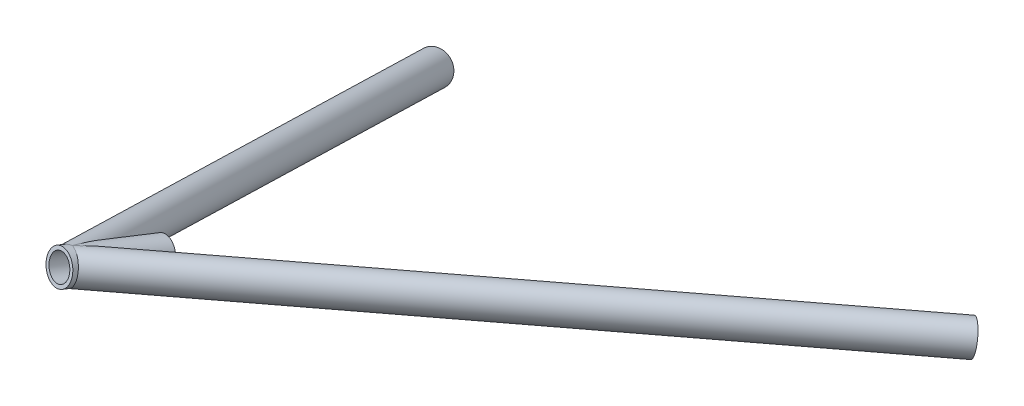
ISO-10303-21;
HEADER;
FILE_DESCRIPTION(('STEP AP214'),'2;1');
FILE_NAME('part.step','',(''),(''),'','','');
FILE_SCHEMA(('AUTOMOTIVE_DESIGN { 1 0 10303 214 1 1 1 1 }'));
ENDSEC;
DATA;
#1=APPLICATION_CONTEXT('core data for automotive mechanical design processes');
#2=APPLICATION_PROTOCOL_DEFINITION('international standard','automotive_design',2000,#1);
#3=PRODUCT_CONTEXT('',#1,'mechanical');
#4=PRODUCT('Part','Part','',(#3));
#5=PRODUCT_RELATED_PRODUCT_CATEGORY('part','',(#4));
#6=PRODUCT_DEFINITION_FORMATION('','',#4);
#7=PRODUCT_DEFINITION_CONTEXT('part definition',#1,'design');
#8=PRODUCT_DEFINITION('design','',#6,#7);
#9=PRODUCT_DEFINITION_SHAPE('','',#8);
#10=(LENGTH_UNIT() NAMED_UNIT(*) SI_UNIT(.MILLI.,.METRE.));
#11=(NAMED_UNIT(*) PLANE_ANGLE_UNIT() SI_UNIT($,.RADIAN.));
#12=(NAMED_UNIT(*) SI_UNIT($,.STERADIAN.) SOLID_ANGLE_UNIT());
#13=UNCERTAINTY_MEASURE_WITH_UNIT(LENGTH_MEASURE(1.E-05),#10,'distance_accuracy_value','');
#14=(GEOMETRIC_REPRESENTATION_CONTEXT(3) GLOBAL_UNCERTAINTY_ASSIGNED_CONTEXT((#13)) GLOBAL_UNIT_ASSIGNED_CONTEXT((#10,
#11,#12)) REPRESENTATION_CONTEXT('',''));
#15=CARTESIAN_POINT('',(0.,0.,0.));
#16=DIRECTION('',(0.,0.,1.));
#17=DIRECTION('',(1.,0.,0.));
#18=AXIS2_PLACEMENT_3D('',#15,#16,#17);
#19=CARTESIAN_POINT('',(1696.18593125395,298.313265774571,609.984435723738));
#20=DIRECTION('',(0.586936783063146,-0.193365264339262,-0.786202955498447));
#21=DIRECTION('',(-0.801326519780633,0.,-0.598227221627584));
#22=AXIS2_PLACEMENT_3D('',#19,#20,#21);
#23=CYLINDRICAL_SURFACE('',#22,7.41680000000007);
#24=CARTESIAN_POINT('',(1929.45721259279,221.462462961638,297.517103442446));
#25=DIRECTION('',(-0.586936783063146,0.193365264339262,0.786202955498447));
#26=DIRECTION('',(0.801326519780633,0.,0.598227221627584));
#27=AXIS2_PLACEMENT_3D('',#24,#25,#26);
#28=CIRCLE('',#27,7.41680000000007);
#29=CARTESIAN_POINT('',(1935.4004911247,221.462462961638,301.954035099813));
#30=VERTEX_POINT('',#29);
#31=EDGE_CURVE('E107',#30,#30,#28,.T.);
#32=ORIENTED_EDGE('',*,*,#31,.F.);
#33=EDGE_LOOP('',(#32));
#34=FACE_BOUND('',#33,.T.);
#35=CARTESIAN_POINT('',(1712.03955486723,291.132315684709,576.350511508126));
#36=CARTESIAN_POINT('',(1712.07658497035,291.016248629587,576.300908607568));
#37=CARTESIAN_POINT('',(1712.11207509683,290.897242727666,576.256864690043));
#38=CARTESIAN_POINT('',(1712.17864311787,290.653362032852,576.183487458711));
#39=CARTESIAN_POINT('',(1712.20971879644,290.52848433398,576.154161514517));
#40=CARTESIAN_POINT('',(1712.26594423027,290.27230217174,576.114550975179));
#41=CARTESIAN_POINT('',(1712.29100463676,290.140932082762,576.1045395689));
#42=CARTESIAN_POINT('',(1712.33218706204,289.877324729745,576.109257153488));
#43=CARTESIAN_POINT('',(1712.34833512454,289.74509114725,576.12391354621));
#44=CARTESIAN_POINT('',(1712.36873326322,289.500791048101,576.176674578998));
#45=CARTESIAN_POINT('',(1712.37416018927,289.388182955529,576.21181578729));
#46=CARTESIAN_POINT('',(1712.37668060772,289.170742355862,576.301338622151));
#47=CARTESIAN_POINT('',(1712.37376445541,289.065918991679,576.355742452868));
#48=CARTESIAN_POINT('',(1712.35948631222,288.850410188001,576.49016313902));
#49=CARTESIAN_POINT('',(1712.3468294117,288.741538143218,576.572904944146));
#50=CARTESIAN_POINT('',(1712.31382051871,288.53810421147,576.753064671234));
#51=CARTESIAN_POINT('',(1712.29345401726,288.443569779741,576.850510055139));
#52=CARTESIAN_POINT('',(1712.25053414276,288.280529543587,577.039905272961));
#53=CARTESIAN_POINT('',(1712.22875111139,288.21024232212,577.130532365055));
#54=CARTESIAN_POINT('',(1712.18204352185,288.07780028612,577.31683563695));
#55=CARTESIAN_POINT('',(1712.15711652896,288.015651851273,577.412515696118));
#56=CARTESIAN_POINT('',(1712.10479601727,287.898263920755,577.607647609773));
#57=CARTESIAN_POINT('',(1712.07739689197,287.843040844464,577.707107725782));
#58=CARTESIAN_POINT('',(1712.02071898795,287.738682589971,577.908580036128));
#59=CARTESIAN_POINT('',(1711.9914407935,287.68954553322,578.010591431227));
#60=CARTESIAN_POINT('',(1711.91693730902,287.574089366037,578.266078100127));
#61=CARTESIAN_POINT('',(1711.87081821702,287.51088127217,578.420694893387));
#62=CARTESIAN_POINT('',(1711.77617789931,287.393734608016,578.732714793343));
#63=CARTESIAN_POINT('',(1711.72765543724,287.339800873888,578.890119306809));
#64=CARTESIAN_POINT('',(1711.62872894047,287.239552813774,579.207061835553));
#65=CARTESIAN_POINT('',(1711.57832175554,287.193252014725,579.366603108042));
#66=CARTESIAN_POINT('',(1711.47611842774,287.107161490387,579.686996390202));
#67=CARTESIAN_POINT('',(1711.42432212099,287.067372537371,579.847848552966));
#68=CARTESIAN_POINT('',(1711.31934552606,286.993160402487,580.171398701596));
#69=CARTESIAN_POINT('',(1711.26615899138,286.958769397608,580.334101982764));
#70=CARTESIAN_POINT('',(1711.15891679189,286.894881224651,580.660180432866));
#71=CARTESIAN_POINT('',(1711.10486109718,286.86538422524,580.823555624758));
#72=CARTESIAN_POINT('',(1710.99612147059,286.810721823565,581.150594661971));
#73=CARTESIAN_POINT('',(1710.94143836376,286.78555130336,581.314257931626));
#74=CARTESIAN_POINT('',(1710.83151783514,286.739022711283,581.6419327401));
#75=CARTESIAN_POINT('',(1710.77628041941,286.717664597761,581.805944275096));
#76=CARTESIAN_POINT('',(1710.61641090879,286.66101009951,582.279098936916));
#77=CARTESIAN_POINT('',(1710.51121193253,286.630049333578,582.588573444953));
#78=CARTESIAN_POINT('',(1710.29979138591,286.578181544837,583.208032451481));
#79=CARTESIAN_POINT('',(1710.19356967737,286.557275900549,583.518017014057));
#80=CARTESIAN_POINT('',(1709.98047083585,286.524065369149,584.138370852052));
#81=CARTESIAN_POINT('',(1709.87359342688,286.511764396117,584.448740238297));
#82=CARTESIAN_POINT('',(1709.65954871433,286.494684108432,585.069595275297));
#83=CARTESIAN_POINT('',(1709.55238139593,286.489905185709,585.380080931267));
#84=CARTESIAN_POINT('',(1709.33777682453,286.487030671917,586.00180972391));
#85=CARTESIAN_POINT('',(1709.23033953401,286.488950954797,586.313052911034));
#86=CARTESIAN_POINT('',(1709.01568785097,286.498863734382,586.935522774005));
#87=CARTESIAN_POINT('',(1708.90847346486,286.506856402979,587.246749449136));
#88=CARTESIAN_POINT('',(1708.587564373,286.539144850831,588.180189080425));
#89=CARTESIAN_POINT('',(1708.3745366263,286.571750871382,588.802355268866));
#90=CARTESIAN_POINT('',(1707.952316236,286.656247492503,590.045737529847));
#91=CARTESIAN_POINT('',(1707.74311896728,286.708112970963,590.666953786179));
#92=CARTESIAN_POINT('',(1707.33019693435,286.829636965709,591.909537830945));
#93=CARTESIAN_POINT('',(1707.12647276677,286.899297413179,592.530905628508));
#94=CARTESIAN_POINT('',(1706.72723866972,287.055779916383,593.77306265047));
#95=CARTESIAN_POINT('',(1706.53171643825,287.142575068174,594.393851268229));
#96=CARTESIAN_POINT('',(1706.24682508677,287.28613974271,595.325480851698));
#97=CARTESIAN_POINT('',(1706.15326499031,287.336220102417,595.636081023833));
#98=CARTESIAN_POINT('',(1705.96948073648,287.441054385257,596.257476901621));
#99=CARTESIAN_POINT('',(1705.87925652701,287.495808235362,596.568272604145));
#100=CARTESIAN_POINT('',(1705.66884575387,287.632280011369,597.309592790259));
#101=CARTESIAN_POINT('',(1705.55047230958,287.7162727698,597.740220382242));
#102=CARTESIAN_POINT('',(1705.32342652983,287.895009065529,598.601939264552));
#103=CARTESIAN_POINT('',(1705.21475658885,287.989755243362,599.033030642912));
#104=CARTESIAN_POINT('',(1705.01006728148,288.191851247254,599.895132005038));
#105=CARTESIAN_POINT('',(1704.9140421744,288.299195311779,600.326141936415));
#106=CARTESIAN_POINT('',(1704.78244967651,288.471904816642,600.972009696426));
#107=CARTESIAN_POINT('',(1704.74066305203,288.531417401198,601.187170871958));
#108=CARTESIAN_POINT('',(1704.66187153557,288.65487055869,601.617092313928));
#109=CARTESIAN_POINT('',(1704.62486638679,288.718810893548,601.831852601285));
#110=CARTESIAN_POINT('',(1704.54476534034,288.874205525519,602.333200559642));
#111=CARTESIAN_POINT('',(1704.50383897657,288.967654251779,602.619528522018));
#112=CARTESIAN_POINT('',(1704.43384741731,289.165486774651,603.189963268197));
#113=CARTESIAN_POINT('',(1704.40478422379,289.269872413183,603.474069669174));
#114=CARTESIAN_POINT('',(1704.36094240185,289.491798423494,604.03771681313));
#115=CARTESIAN_POINT('',(1704.34613858625,289.609315189554,604.31726474588));
#116=CARTESIAN_POINT('',(1704.33329796318,289.860596570841,604.869367488304));
#117=CARTESIAN_POINT('',(1704.33525181188,289.994352090569,605.141926110084));
#118=CARTESIAN_POINT('',(1704.35426843521,290.232517457915,605.584704388796));
#119=CARTESIAN_POINT('',(1704.36595361321,290.331387510807,605.758137095597));
#120=CARTESIAN_POINT('',(1704.39799239082,290.538592473899,606.098396846474));
#121=CARTESIAN_POINT('',(1704.41834295773,290.646924062236,606.265226179281));
#122=CARTESIAN_POINT('',(1704.46776436013,290.873770016219,606.590201417726));
#123=CARTESIAN_POINT('',(1704.49682471037,290.992272016521,606.748357495322));
#124=CARTESIAN_POINT('',(1704.56326373124,291.240145567829,607.054089563841));
#125=CARTESIAN_POINT('',(1704.60064219554,291.369516849172,607.201665817077));
#126=CARTESIAN_POINT('',(1704.68311811871,291.640619794724,607.485491521252));
#127=CARTESIAN_POINT('',(1704.72828560426,291.78245730518,607.621619908406));
#128=CARTESIAN_POINT('',(1704.82447361544,292.077179649872,607.879072530503));
#129=CARTESIAN_POINT('',(1704.87549426741,292.230064722526,608.000396445798));
#130=CARTESIAN_POINT('',(1704.98132967104,292.546278093969,608.226880518623));
#131=CARTESIAN_POINT('',(1705.03614642522,292.709611901163,608.332032049229));
#132=CARTESIAN_POINT('',(1705.14720860748,293.045617626346,608.525251546435));
#133=CARTESIAN_POINT('',(1705.20345395814,293.218289038873,608.613320436571));
#134=CARTESIAN_POINT('',(1705.30837622991,293.550679829153,608.762647489244));
#135=CARTESIAN_POINT('',(1705.35715802747,293.709498801764,608.825848254794));
#136=CARTESIAN_POINT('',(1705.45248350064,294.032461888309,608.938857730564));
#137=CARTESIAN_POINT('',(1705.49902740069,294.196605465476,608.988667786012));
#138=CARTESIAN_POINT('',(1705.58852376935,294.529276010192,609.075171276163));
#139=CARTESIAN_POINT('',(1705.63147593536,294.69780334551,609.111863606543));
#140=CARTESIAN_POINT('',(1705.71261039163,295.038266432537,609.172510059636));
#141=CARTESIAN_POINT('',(1705.75079239992,295.210202385042,609.19646342959));
#142=CARTESIAN_POINT('',(1705.82309969626,295.564865641273,609.232924731367));
#143=CARTESIAN_POINT('',(1705.85694056217,295.747713503338,609.244825019672));
#144=CARTESIAN_POINT('',(1705.91737346114,296.114980798895,609.255627149784));
#145=CARTESIAN_POINT('',(1705.94396535543,296.299400262402,609.254528742776));
#146=CARTESIAN_POINT('',(1705.98919598081,296.668744074213,609.239840107601));
#147=CARTESIAN_POINT('',(1706.00783345101,296.853668497888,609.226247900067));
#148=CARTESIAN_POINT('',(1706.0366374073,297.222903596839,609.187043675306));
#149=CARTESIAN_POINT('',(1706.04680359533,297.407214250293,609.1614312352));
#150=CARTESIAN_POINT('',(1706.05866768977,297.784757426962,609.096797170882));
#151=CARTESIAN_POINT('',(1706.05984126695,297.977888725907,609.057085089235));
#152=CARTESIAN_POINT('',(1706.05215826392,298.360949181745,608.965140535468));
#153=CARTESIAN_POINT('',(1706.04330128961,298.550878212518,608.912907571446));
#154=CARTESIAN_POINT('',(1706.01558840952,298.926268314493,608.796297006398));
#155=CARTESIAN_POINT('',(1705.99673050142,299.111728483189,608.731916975022));
#156=CARTESIAN_POINT('',(1705.94925953409,299.476832263983,608.591343453487));
#157=CARTESIAN_POINT('',(1705.92064647299,299.656475874966,608.515149961061));
#158=CARTESIAN_POINT('',(1705.8536084474,300.01136652067,608.349938638769));
#159=CARTESIAN_POINT('',(1705.81503816357,300.186502127179,608.260740209218));
#160=CARTESIAN_POINT('',(1705.7290308067,300.528037493043,608.070645091176));
#161=CARTESIAN_POINT('',(1705.68159356712,300.69443708822,607.969748182946));
#162=CARTESIAN_POINT('',(1705.57882728298,301.017119334387,607.756420050968));
#163=CARTESIAN_POINT('',(1705.52349776992,301.173401383967,607.643988142578));
#164=CARTESIAN_POINT('',(1705.4062046115,301.474454049306,607.407741797848));
#165=CARTESIAN_POINT('',(1705.34424113265,301.619224953808,607.283927647184));
#166=CARTESIAN_POINT('',(1705.21647409177,301.893242186314,607.027569489089));
#167=CARTESIAN_POINT('',(1705.15076745947,302.022733790484,606.895239513668));
#168=CARTESIAN_POINT('',(1705.01621125525,302.268144654332,606.619999881119));
#169=CARTESIAN_POINT('',(1704.94736172586,302.384064097564,606.477090367116));
#170=CARTESIAN_POINT('',(1704.80858898827,302.601163358166,606.181177102642));
#171=CARTESIAN_POINT('',(1704.73866678405,302.702356127568,606.028182396257));
#172=CARTESIAN_POINT('',(1704.5998950309,302.889276124267,605.712562706909));
#173=CARTESIAN_POINT('',(1704.53104539699,302.975004582326,605.549938491701));
#174=CARTESIAN_POINT('',(1704.40117202867,303.125323263886,605.227052195232));
#175=CARTESIAN_POINT('',(1704.33993250385,303.190941240857,605.067354524121));
#176=CARTESIAN_POINT('',(1704.22214045227,303.308232177363,604.741266988864));
#177=CARTESIAN_POINT('',(1704.16558751942,303.359906345979,604.574877706392));
#178=CARTESIAN_POINT('',(1704.05872075458,303.449644490273,604.236601319506));
#179=CARTESIAN_POINT('',(1704.0084046057,303.487713530049,604.064716286726));
#180=CARTESIAN_POINT('',(1703.91514782067,303.55100641991,603.716639111886));
#181=CARTESIAN_POINT('',(1703.87220807618,303.576228717816,603.540446452059));
#182=CARTESIAN_POINT('',(1703.78520758005,303.619457308225,603.142781500165));
#183=CARTESIAN_POINT('',(1703.74330303626,303.634326728683,602.920494414113));
#184=CARTESIAN_POINT('',(1703.67239126969,303.648368121494,602.47340078925));
#185=CARTESIAN_POINT('',(1703.64338774189,303.647535599609,602.248593547517));
#186=CARTESIAN_POINT('',(1703.5978495116,303.632657832155,601.797727012063));
#187=CARTESIAN_POINT('',(1703.58134151676,303.61858442893,601.571666070991));
#188=CARTESIAN_POINT('',(1703.55997707323,303.579527039727,601.120001136951));
#189=CARTESIAN_POINT('',(1703.55512026607,303.554543389448,600.894397130138));
#190=CARTESIAN_POINT('',(1703.5559323487,303.491742714728,600.414230301334));
#191=CARTESIAN_POINT('',(1703.5630999596,303.452654070101,600.159840792459));
#192=CARTESIAN_POINT('',(1703.58911866983,303.365420496443,599.653177006584));
#193=CARTESIAN_POINT('',(1703.60797435236,303.317272019988,599.400903598709));
#194=CARTESIAN_POINT('',(1703.65572407664,303.213680985801,598.898446807011));
#195=CARTESIAN_POINT('',(1703.68463333582,303.158227450381,598.648267183648));
#196=CARTESIAN_POINT('',(1703.75098934619,303.041478162259,598.150473507433));
#197=CARTESIAN_POINT('',(1703.78843509029,302.9801830992,597.902859155546));
#198=CARTESIAN_POINT('',(1703.87087758781,302.852339427442,597.408400278013));
#199=CARTESIAN_POINT('',(1703.91592475676,302.785757427161,597.161572910494));
#200=CARTESIAN_POINT('',(1704.0122978258,302.648497064351,596.670302154552));
#201=CARTESIAN_POINT('',(1704.06362384223,302.577818625928,596.425858810395));
#202=CARTESIAN_POINT('',(1704.17159937122,302.433011152021,595.939430989684));
#203=CARTESIAN_POINT('',(1704.22824420519,302.358885177529,595.697444555818));
#204=CARTESIAN_POINT('',(1704.34614364864,302.207554832535,595.215572877502));
#205=CARTESIAN_POINT('',(1704.40739826788,302.130350455509,594.975687637506));
#206=CARTESIAN_POINT('',(1704.5467859319,301.957156780336,594.449160561819));
#207=CARTESIAN_POINT('',(1704.62581357066,301.860547406341,594.162959869139));
#208=CARTESIAN_POINT('',(1704.7887467536,301.663719654699,593.59319492726));
#209=CARTESIAN_POINT('',(1704.87265253049,301.563501104967,593.309630804584));
#210=CARTESIAN_POINT('',(1705.13058945763,301.257820598425,592.462536584149));
#211=CARTESIAN_POINT('',(1705.31081776212,301.047361283926,591.902687588168));
#212=CARTESIAN_POINT('',(1705.6836465492,300.613953135062,590.791188069946));
#213=CARTESIAN_POINT('',(1705.87626226424,300.390988968622,590.239548709899));
#214=CARTESIAN_POINT('',(1706.27068153954,299.932914349967,589.144741210977));
#215=CARTESIAN_POINT('',(1706.47248416153,299.697805137811,588.601572214588));
#216=CARTESIAN_POINT('',(1706.88215539226,299.216002668607,587.526206723237));
#217=CARTESIAN_POINT('',(1707.08999035675,298.969370220874,586.993970162816));
#218=CARTESIAN_POINT('',(1707.51105714415,298.462282324065,585.938218662376));
#219=CARTESIAN_POINT('',(1707.7242894323,298.201825681233,585.414704480703));
#220=CARTESIAN_POINT('',(1708.15460034563,297.665546212208,584.378035458822));
#221=CARTESIAN_POINT('',(1708.37167423167,297.389741526229,583.86486932628));
#222=CARTESIAN_POINT('',(1708.69945495501,296.962200910789,583.103898382084));
#223=CARTESIAN_POINT('',(1708.80906955099,296.817391771962,582.851720770466));
#224=CARTESIAN_POINT('',(1709.02888266129,296.522653990563,582.350637886731));
#225=CARTESIAN_POINT('',(1709.13908116027,296.372725482014,582.101732529183));
#226=CARTESIAN_POINT('',(1709.38945334214,296.026272747809,581.541531209966));
#227=CARTESIAN_POINT('',(1709.52975832569,295.828014426476,581.231360573142));
#228=CARTESIAN_POINT('',(1709.81072055274,295.420670961973,580.618215387168));
#229=CARTESIAN_POINT('',(1709.95137788129,295.211582903126,580.315242808305));
#230=CARTESIAN_POINT('',(1710.23289469247,294.779844509073,579.717717254329));
#231=CARTESIAN_POINT('',(1710.37375373002,294.557159862633,579.423188589689));
#232=CARTESIAN_POINT('',(1710.58427563444,294.210981826128,578.990870864079));
#233=CARTESIAN_POINT('',(1710.65430818037,294.09358816069,578.848371160794));
#234=CARTESIAN_POINT('',(1710.79397854943,293.854173791045,578.567123597279));
#235=CARTESIAN_POINT('',(1710.86361640467,293.732153469661,578.428375428255));
#236=CARTESIAN_POINT('',(1711.01390714151,293.461958055479,578.13257659927));
#237=CARTESIAN_POINT('',(1711.09445464047,293.31282143593,577.97634529486));
#238=CARTESIAN_POINT('',(1711.25427434336,293.00598957127,577.671885138285));
#239=CARTESIAN_POINT('',(1711.33354699889,292.848297447432,577.523653406513));
#240=CARTESIAN_POINT('',(1711.48966857923,292.523397497416,577.238686306058));
#241=CARTESIAN_POINT('',(1711.56652852091,292.356247391498,577.101891654054));
#242=CARTESIAN_POINT('',(1711.71698221622,292.00945358416,576.84332265971));
#243=CARTESIAN_POINT('',(1711.79058114109,291.829830914455,576.721523948483));
#244=CARTESIAN_POINT('',(1711.89235972764,291.560638171652,576.56260808444));
#245=CARTESIAN_POINT('',(1711.92279035208,291.477277852551,576.516409730959));
#246=CARTESIAN_POINT('',(1711.98229705649,291.307286152517,576.429235128493));
#247=CARTESIAN_POINT('',(1712.01137197277,291.220652072912,576.388263315261));
#248=CARTESIAN_POINT('',(1712.03955486723,291.132315684709,576.350511508126));
#249=B_SPLINE_CURVE_WITH_KNOTS('',3,(#35,#36,#37,#38,#39,#40,#41,#42,#43,#44,#45,#46,#47,#48,
#49,#50,#51,#52,#53,#54,#55,#56,#57,#58,#59,#60,#61,#62,#63,#64,#65,#66,#67,#68,#69,#70,#71,#72,
#73,#74,#75,#76,#77,#78,#79,#80,#81,#82,#83,#84,#85,#86,#87,#88,#89,#90,#91,#92,#93,#94,#95,#96,
#97,#98,#99,#100,#101,#102,#103,#104,#105,#106,#107,#108,#109,#110,#111,#112,#113,#114,#115,
#116,#117,#118,#119,#120,#121,#122,#123,#124,#125,#126,#127,#128,#129,#130,#131,#132,#133,#134,
#135,#136,#137,#138,#139,#140,#141,#142,#143,#144,#145,#146,#147,#148,#149,#150,#151,#152,#153,
#154,#155,#156,#157,#158,#159,#160,#161,#162,#163,#164,#165,#166,#167,#168,#169,#170,#171,#172,
#173,#174,#175,#176,#177,#178,#179,#180,#181,#182,#183,#184,#185,#186,#187,#188,#189,#190,#191,
#192,#193,#194,#195,#196,#197,#198,#199,#200,#201,#202,#203,#204,#205,#206,#207,#208,#209,#210,
#211,#212,#213,#214,#215,#216,#217,#218,#219,#220,#221,#222,#223,#224,#225,#226,#227,#228,#229,
#230,#231,#232,#233,#234,#235,#236,#237,#238,#239,#240,#241,#242,#243,#244,#245,#246,#247,#248),
.UNSPECIFIED.,.T.,.F.,(4,2,2,2,2,2,2,2,2,2,2,2,2,2,2,2,2,2,2,2,2,2,2,2,2,2,2,2,2,2,2,2,2,2,2,2,
2,2,2,2,2,2,2,2,2,2,2,2,2,2,2,2,2,2,2,2,2,2,2,2,2,2,2,2,2,2,2,2,2,2,2,2,2,2,2,2,2,2,2,2,2,2,2,2,
2,2,2,2,2,2,2,2,2,2,2,2,2,2,2,2,2,2,2,2,2,2,4),(0.,0.394479960414139,0.789157249077542,
1.18937714890788,1.58842124686282,1.94048993548404,2.29296578432835,2.70269383345527,
3.11319682899353,3.46291656384146,3.81290881050168,4.16371576864112,4.51441417317343,
5.03388223412165,5.55362035807055,6.07426987419945,6.59498109210988,7.11868713993254,
7.64241123281382,8.16551146586819,8.68860598382093,9.67338228691278,10.6582935608705,
11.6436525590599,12.6290628971506,13.6168097760679,14.6045846163618,16.5795198556668,
18.5518879798443,20.5244702445624,22.4939795593056,23.4786235686581,24.463252194514,
25.8263424742537,27.1897681921569,28.5525727713968,29.233846823071,29.9150842714979,
30.8266012439973,31.7382719753394,32.6483293992263,33.5578794217347,34.1573692895057,
34.7566495212298,35.3552111897963,35.9537580127405,36.5579969772525,37.162248985774,
37.7668222140867,38.3713627483271,38.9040382537944,39.4366602267603,39.9693270282317,
40.5020253020805,41.0604121793175,41.6188097449805,42.1772957916484,42.7358014875993,
43.3266408704121,43.9175034690095,44.5084844112902,45.0994654669226,45.6996139564552,
46.2997737207312,46.8999691272002,47.5001494737875,48.0887718405203,48.6773862456055,
49.2654797976725,49.8535265243029,50.4023971895076,50.9512202462929,51.4998388070191,
52.0485236376751,52.7275318486041,53.4067344093505,54.0873846141912,54.7680138774823,
55.5399089711857,56.3121069356948,57.0854788492107,57.8587595723828,58.6373865266265,
59.4160279109717,60.1939906843298,60.9719551066907,61.9085698345909,62.8452292791281,
64.7188186691671,66.5947577232883,68.4705056137101,70.3372785186765,72.2042128875395,
74.068985707636,75.0012492684392,75.9334884415991,77.115155291376,78.2971419503623,
79.4822456468993,80.0745654263381,80.6668363017866,81.358149842198,82.0492128473245,
82.7364373368713,83.4225298965663,83.722508035468,84.0227390948778),.UNSPECIFIED.);
#250=CARTESIAN_POINT('',(1712.03955486723,291.132315684709,576.350511508126));
#251=VERTEX_POINT('',#250);
#252=EDGE_CURVE('E81',#251,#251,#249,.T.);
#253=ORIENTED_EDGE('',*,*,#252,.T.);
#254=EDGE_LOOP('',(#253));
#255=FACE_BOUND('',#254,.T.);
#256=ADVANCED_FACE('F63',(#34,#255),#23,.F.);
#257=CARTESIAN_POINT('',(1695.27005223557,299.62724687487,614.720955468418));
#258=DIRECTION('',(0.18317580367567,-0.262796220059855,-0.94730394893615));
#259=DIRECTION('',(0.,0.963608030897897,-0.267319215151245));
#260=AXIS2_PLACEMENT_3D('',#257,#258,#259);
#261=CYLINDRICAL_SURFACE('',#260,9.52500000000009);
#262=ORIENTED_EDGE('',*,*,#252,.F.);
#263=EDGE_LOOP('',(#262));
#264=FACE_BOUND('',#263,.T.);
#265=CARTESIAN_POINT('',(1696.18593125395,298.313265774571,609.984435723737));
#266=DIRECTION('',(0.394737380314413,-0.233815149177805,-0.88854537115303));
#267=DIRECTION('',(0.917171793543887,0.157717356150483,0.365952369436776));
#268=AXIS2_PLACEMENT_3D('',#265,#266,#267);
#269=ELLIPSE('',#268,9.76447759000194,9.52500000000002);
#270=CARTESIAN_POINT('',(1696.70574687903,289.174944281087,612.620056523028));
#271=VERTEX_POINT('',#270);
#272=CARTESIAN_POINT('',(1695.66611562887,307.451587268054,607.348814924446));
#273=VERTEX_POINT('',#272);
#274=EDGE_CURVE('E72',#271,#273,#269,.F.);
#275=ORIENTED_EDGE('',*,*,#274,.T.);
#276=CARTESIAN_POINT('',(1696.18593125395,298.313265774571,609.984435723737));
#277=DIRECTION('',(0.917171793543887,0.157717356150483,0.365952369436776));
#278=DIRECTION('',(0.394737380314413,-0.233815149177805,-0.88854537115303));
#279=AXIS2_PLACEMENT_3D('',#276,#277,#278);
#280=ELLIPSE('',#279,43.2734304674936,9.52500000000002);
#281=EDGE_CURVE('E13',#273,#271,#280,.F.);
#282=ORIENTED_EDGE('',*,*,#281,.T.);
#283=EDGE_LOOP('',(#275,#282));
#284=FACE_BOUND('',#283,.T.);
#285=ADVANCED_FACE('F79',(#264,#284),#261,.F.);
#286=CARTESIAN_POINT('',(1696.18593125395,298.313265774571,609.984435723738));
#287=DIRECTION('',(0.586936783063146,-0.193365264339262,-0.786202955498447));
#288=DIRECTION('',(-0.801326519780633,0.,-0.598227221627584));
#289=AXIS2_PLACEMENT_3D('',#286,#287,#288);
#290=CYLINDRICAL_SURFACE('',#289,9.52499999999996);
#291=CARTESIAN_POINT('',(1929.45721259279,221.462462961638,297.517103442446));
#292=DIRECTION('',(-0.586936783063146,0.193365264339262,0.786202955498447));
#293=DIRECTION('',(0.801326519780633,0.,0.598227221627584));
#294=AXIS2_PLACEMENT_3D('',#291,#292,#293);
#295=CIRCLE('',#294,9.52499999999996);
#296=CARTESIAN_POINT('',(1937.0898476937,221.462462961638,303.215217728448));
#297=VERTEX_POINT('',#296);
#298=EDGE_CURVE('E67',#297,#297,#295,.T.);
#299=ORIENTED_EDGE('',*,*,#298,.T.);
#300=EDGE_LOOP('',(#299));
#301=FACE_BOUND('',#300,.T.);
#302=ORIENTED_EDGE('',*,*,#274,.F.);
#303=ORIENTED_EDGE('',*,*,#281,.F.);
#304=EDGE_LOOP('',(#302,#303));
#305=FACE_BOUND('',#304,.T.);
#306=ADVANCED_FACE('F65',(#301,#305),#290,.T.);
#307=CARTESIAN_POINT('',(1929.45721259279,221.462462961638,297.517103442446));
#308=DIRECTION('',(-0.586936783063146,0.193365264339262,0.786202955498447));
#309=DIRECTION('',(0.801326519780633,0.,0.598227221627584));
#310=AXIS2_PLACEMENT_3D('',#307,#308,#309);
#311=PLANE('',#310);
#312=ORIENTED_EDGE('',*,*,#31,.T.);
#313=EDGE_LOOP('',(#312));
#314=FACE_BOUND('',#313,.T.);
#315=ORIENTED_EDGE('',*,*,#298,.F.);
#316=EDGE_LOOP('',(#315));
#317=FACE_BOUND('',#316,.T.);
#318=ADVANCED_FACE('F84',(#314,#317),#311,.F.);
#319=CLOSED_SHELL('',(#256,#285,#306,#318));
#320=MANIFOLD_SOLID_BREP('B2',#319);
#321=CARTESIAN_POINT('',(1600.,194.785610189008,270.));
#322=DIRECTION('',(0.261244511464905,0.281184903592084,0.923410177126814));
#323=DIRECTION('',(0.,-0.956631443980582,0.291301013365261));
#324=AXIS2_PLACEMENT_3D('',#321,#322,#323);
#325=CYLINDRICAL_SURFACE('',#324,7.41680000000007);
#326=CARTESIAN_POINT('',(1609.14355790127,204.627081814731,302.319356199439));
#327=DIRECTION('',(0.261244511464905,0.281184903592084,0.923410177126814));
#328=DIRECTION('',(0.,-0.956631443980581,0.291301013365261));
#329=AXIS2_PLACEMENT_3D('',#326,#327,#328);
#330=CIRCLE('',#329,7.41680000000007);
#331=CARTESIAN_POINT('',(1609.14355790127,197.531937721016,304.479877555366));
#332=VERTEX_POINT('',#331);
#333=EDGE_CURVE('E189',#332,#332,#330,.T.);
#334=ORIENTED_EDGE('',*,*,#333,.F.);
#335=EDGE_LOOP('',(#334));
#336=FACE_BOUND('',#335,.T.);
#337=CARTESIAN_POINT('',(1692.80899171428,287.583425535191,600.208628461756));
#338=CARTESIAN_POINT('',(1692.8639822694,287.511107247045,599.971138501752));
#339=CARTESIAN_POINT('',(1692.91523866587,287.441230702867,599.732040339298));
#340=CARTESIAN_POINT('',(1693.01128496172,287.305691435197,599.251349878067));
#341=CARTESIAN_POINT('',(1693.05607406018,287.240029234167,599.009757274343));
#342=CARTESIAN_POINT('',(1693.1400571916,287.11238606106,598.524525649544));
#343=CARTESIAN_POINT('',(1693.17924875882,287.050406718274,598.280885776369));
#344=CARTESIAN_POINT('',(1693.25274230743,286.929768019205,597.792046417658));
#345=CARTESIAN_POINT('',(1693.28704401484,286.87110884906,597.546846845535));
#346=CARTESIAN_POINT('',(1693.38369839215,286.699416204381,596.808395251278));
#347=CARTESIAN_POINT('',(1693.43964085469,286.590915190542,596.313243936816));
#348=CARTESIAN_POINT('',(1693.53836081826,286.38441717947,595.319632358329));
#349=CARTESIAN_POINT('',(1693.58114127334,286.286417828491,594.821172862479));
#350=CARTESIAN_POINT('',(1693.65654903037,286.099574102431,593.81896586568));
#351=CARTESIAN_POINT('',(1693.68911977823,286.010782483443,593.315204349907));
#352=CARTESIAN_POINT('',(1693.74587391296,285.842650823687,592.305620899133));
#353=CARTESIAN_POINT('',(1693.77005685364,285.763311285874,591.799798855968));
#354=CARTESIAN_POINT('',(1693.81154289898,285.614275750013,590.787157156084));
#355=CARTESIAN_POINT('',(1693.82885523119,285.544566900149,590.280339762402));
#356=CARTESIAN_POINT('',(1693.85779515772,285.415089960422,589.265289822192));
#357=CARTESIAN_POINT('',(1693.8694229407,285.355321540693,588.757057323192));
#358=CARTESIAN_POINT('',(1693.88603244484,285.257268075335,587.84012707452));
#359=CARTESIAN_POINT('',(1693.89187427465,285.217072529904,587.431648385249));
#360=CARTESIAN_POINT('',(1693.90080146888,285.144145972156,586.613994600742));
#361=CARTESIAN_POINT('',(1693.90388685982,285.111414887977,586.204819512249));
#362=CARTESIAN_POINT('',(1693.90757868103,285.054156579552,585.385474821867));
#363=CARTESIAN_POINT('',(1693.90818266903,285.029637459469,584.975304637568));
#364=CARTESIAN_POINT('',(1693.90711848645,284.989875294927,584.15452325771));
#365=CARTESIAN_POINT('',(1693.90545039112,284.97463194326,583.743912077209));
#366=CARTESIAN_POINT('',(1693.90002349966,284.954880410247,582.925941586555));
#367=CARTESIAN_POINT('',(1693.89628269023,284.950281610597,582.518584470524));
#368=CARTESIAN_POINT('',(1693.886825032,284.95338806345,581.703955956813));
#369=CARTESIAN_POINT('',(1693.88110833283,284.961092384409,581.296684554978));
#370=CARTESIAN_POINT('',(1693.86775398958,284.991334035881,580.483194438576));
#371=CARTESIAN_POINT('',(1693.86011885493,285.013852050936,580.076975043815));
#372=CARTESIAN_POINT('',(1693.84720773639,285.061582247416,579.468841287777));
#373=CARTESIAN_POINT('',(1693.8426617,285.079814309669,579.266357551059));
#374=CARTESIAN_POINT('',(1693.83307152394,285.121595488103,578.861955159232));
#375=CARTESIAN_POINT('',(1693.82802741835,285.145144240624,578.660036466429));
#376=CARTESIAN_POINT('',(1693.81805760691,285.195188733485,578.281118120289));
#377=CARTESIAN_POINT('',(1693.81318989179,285.220995171703,578.104026419644));
#378=CARTESIAN_POINT('',(1693.80303626502,285.27807271536,577.750709083352));
#379=CARTESIAN_POINT('',(1693.79775030838,285.309344409098,577.574483543044));
#380=CARTESIAN_POINT('',(1693.78670380117,285.378451517512,577.222238832251));
#381=CARTESIAN_POINT('',(1693.78094062108,285.416324771143,577.046227088337));
#382=CARTESIAN_POINT('',(1693.76893506836,285.499682438771,576.696044139799));
#383=CARTESIAN_POINT('',(1693.76269278434,285.545165447078,576.521872601555));
#384=CARTESIAN_POINT('',(1693.74958304178,285.646089894957,576.173471178736));
#385=CARTESIAN_POINT('',(1693.74270734201,285.701675768874,575.999282865821));
#386=CARTESIAN_POINT('',(1693.72834956183,285.824584390309,575.654844845826));
#387=CARTESIAN_POINT('',(1693.72086687907,285.891918875266,575.484599272251));
#388=CARTESIAN_POINT('',(1693.70529663126,286.040668842312,575.152002539576));
#389=CARTESIAN_POINT('',(1693.69721464733,286.121961873525,574.989597272352));
#390=CARTESIAN_POINT('',(1693.68033725906,286.302805669349,574.67550588413));
#391=CARTESIAN_POINT('',(1693.67154384107,286.402306516015,574.523791989876));
#392=CARTESIAN_POINT('',(1693.65613330179,286.589026104584,574.283511533164));
#393=CARTESIAN_POINT('',(1693.64971307732,286.670092609595,574.190203435241));
#394=CARTESIAN_POINT('',(1693.6365677946,286.844297662996,574.015435116036));
#395=CARTESIAN_POINT('',(1693.62984280828,286.937433371967,573.933972117594));
#396=CARTESIAN_POINT('',(1693.61612133706,287.137351566657,573.786678730496));
#397=CARTESIAN_POINT('',(1693.60912253408,287.244287397648,573.721052296129));
#398=CARTESIAN_POINT('',(1693.59517735755,287.468876332885,573.611885506553));
#399=CARTESIAN_POINT('',(1693.58823091963,287.586512600157,573.5683111384));
#400=CARTESIAN_POINT('',(1693.57545383209,287.814299644895,573.509440963934));
#401=CARTESIAN_POINT('',(1693.5695863479,287.923771280006,573.491484201594));
#402=CARTESIAN_POINT('',(1693.5582694018,288.144195849021,573.474287697377));
#403=CARTESIAN_POINT('',(1693.55282035872,288.255150139837,573.475066469136));
#404=CARTESIAN_POINT('',(1693.54058144624,288.514494026956,573.496185477402));
#405=CARTESIAN_POINT('',(1693.53399502498,288.662308919462,573.523316842955));
#406=CARTESIAN_POINT('',(1693.52167946493,288.951923125907,573.600256490058));
#407=CARTESIAN_POINT('',(1693.51595252866,289.09370633916,573.650121754287));
#408=CARTESIAN_POINT('',(1693.5057532045,289.356647403542,573.760634147229));
#409=CARTESIAN_POINT('',(1693.50121288989,289.478465797569,573.819748460235));
#410=CARTESIAN_POINT('',(1693.49261419905,289.71668221647,573.948175431536));
#411=CARTESIAN_POINT('',(1693.48855625474,289.833075327526,574.017497107356));
#412=CARTESIAN_POINT('',(1693.48082468459,290.061047441293,574.164089978906));
#413=CARTESIAN_POINT('',(1693.4771518844,290.172615811922,574.241377576148));
#414=CARTESIAN_POINT('',(1693.47012441374,290.391166046699,574.402065113797));
#415=CARTESIAN_POINT('',(1693.466769621,290.498149664989,574.485462682809));
#416=CARTESIAN_POINT('',(1693.45844091285,290.768945676311,574.706927242627));
#417=CARTESIAN_POINT('',(1693.45365552654,290.929757059366,574.848664807662));
#418=CARTESIAN_POINT('',(1693.44452304951,291.243066957362,575.141116219558));
#419=CARTESIAN_POINT('',(1693.44017620333,291.395560812618,575.291835000972));
#420=CARTESIAN_POINT('',(1693.43177698761,291.693746741217,575.600385061248));
#421=CARTESIAN_POINT('',(1693.42772519084,291.839425398565,575.758229258449));
#422=CARTESIAN_POINT('',(1693.41981800595,292.12470810272,576.079325939837));
#423=CARTESIAN_POINT('',(1693.41596264102,292.264311431954,576.242579058896));
#424=CARTESIAN_POINT('',(1693.40833621212,292.539236748299,576.574669140969));
#425=CARTESIAN_POINT('',(1693.40456597695,292.674519684067,576.743538346877));
#426=CARTESIAN_POINT('',(1693.39706806902,292.940373952985,577.084946994167));
#427=CARTESIAN_POINT('',(1693.39334039796,293.07094509924,577.257486580704));
#428=CARTESIAN_POINT('',(1693.38587245587,293.327708502215,577.605402272354));
#429=CARTESIAN_POINT('',(1693.38213221084,293.45390681474,577.780773917642));
#430=CARTESIAN_POINT('',(1693.37458073688,293.702541003136,578.134153145686));
#431=CARTESIAN_POINT('',(1693.37076950879,293.82497692391,578.312160696945));
#432=CARTESIAN_POINT('',(1693.35981773272,294.166545234289,578.818989822442));
#433=CARTESIAN_POINT('',(1693.35253649542,294.381693000561,579.150498045779));
#434=CARTESIAN_POINT('',(1693.33730086538,294.802289676077,579.819616531743));
#435=CARTESIAN_POINT('',(1693.32934639369,295.007737443376,580.157227506386));
#436=CARTESIAN_POINT('',(1693.31250271608,295.410203493469,580.837602607702));
#437=CARTESIAN_POINT('',(1693.30361310618,295.607218080925,581.18036890626));
#438=CARTESIAN_POINT('',(1693.28463759736,295.993630080749,581.870138104537));
#439=CARTESIAN_POINT('',(1693.27455166834,296.183027301265,582.217141110676));
#440=CARTESIAN_POINT('',(1693.25286078295,296.555570298107,582.916101398775));
#441=CARTESIAN_POINT('',(1693.24125029368,296.738690082961,583.268072344246));
#442=CARTESIAN_POINT('',(1693.21622249531,297.098440271279,583.975252495668));
#443=CARTESIAN_POINT('',(1693.20280516872,297.27507061193,584.330461732923));
#444=CARTESIAN_POINT('',(1693.17380676198,297.622140114926,585.043648840564));
#445=CARTESIAN_POINT('',(1693.15822644079,297.792581422537,585.401625698419));
#446=CARTESIAN_POINT('',(1693.12447568409,298.127573831415,586.120213443293));
#447=CARTESIAN_POINT('',(1693.10630518868,298.292124796371,586.480824391036));
#448=CARTESIAN_POINT('',(1693.06703878127,298.614071440939,587.20139730559));
#449=CARTESIAN_POINT('',(1693.04596896401,298.771515938216,587.561338876915));
#450=CARTESIAN_POINT('',(1693.000198007,299.080694512357,588.283426974124));
#451=CARTESIAN_POINT('',(1692.97549697146,299.232428752942,588.645573436444));
#452=CARTESIAN_POINT('',(1692.92172331436,299.530121453027,589.37216938161));
#453=CARTESIAN_POINT('',(1692.89264807586,299.676076388472,589.736620117139));
#454=CARTESIAN_POINT('',(1692.82923927427,299.961777231224,590.467490897986));
#455=CARTESIAN_POINT('',(1692.79490582205,300.101523269362,590.833910901628));
#456=CARTESIAN_POINT('',(1692.72001633132,300.373656300288,591.567032717004));
#457=CARTESIAN_POINT('',(1692.67948785353,300.506072512382,591.933726452733));
#458=CARTESIAN_POINT('',(1692.59068968614,300.763341172831,592.668887670648));
#459=CARTESIAN_POINT('',(1692.54241923508,300.888192875515,593.037355323846));
#460=CARTESIAN_POINT('',(1692.43640230176,301.128874171153,593.775464008416));
#461=CARTESIAN_POINT('',(1692.37866560929,301.244712904528,594.145103444688));
#462=CARTESIAN_POINT('',(1692.25141450767,301.465527053191,594.885562875738));
#463=CARTESIAN_POINT('',(1692.18190350992,301.570505600897,595.256382498128));
#464=CARTESIAN_POINT('',(1692.07964643263,301.700975608256,595.750229809213));
#465=CARTESIAN_POINT('',(1692.05343066054,301.73264268253,595.872996889397));
#466=CARTESIAN_POINT('',(1691.99926755925,301.794309986408,596.118570863826));
#467=CARTESIAN_POINT('',(1691.97132018972,301.824310177154,596.241377758933));
#468=CARTESIAN_POINT('',(1691.88468261673,301.911587844605,596.609845128344));
#469=CARTESIAN_POINT('',(1691.82320439492,301.966132729646,596.855515945655));
#470=CARTESIAN_POINT('',(1691.69165209663,302.066400759765,597.346674011488));
#471=CARTESIAN_POINT('',(1691.62156899472,302.112114510554,597.592160790811));
#472=CARTESIAN_POINT('',(1691.471696539,302.192583462997,598.082020178958));
#473=CARTESIAN_POINT('',(1691.39190706968,302.227338534224,598.326392774486));
#474=CARTESIAN_POINT('',(1691.22012511901,302.283730100365,598.817038978878));
#475=CARTESIAN_POINT('',(1691.12795193967,302.305139078307,599.063276730573));
#476=CARTESIAN_POINT('',(1690.93165606749,302.330539657105,599.551983165765));
#477=CARTESIAN_POINT('',(1690.82753264034,302.334530187073,599.794451616613));
#478=CARTESIAN_POINT('',(1690.60773177044,302.321261182944,600.272563538997));
#479=CARTESIAN_POINT('',(1690.49209694166,302.304077528193,600.508228301667));
#480=CARTESIAN_POINT('',(1690.25029193587,302.244721558575,600.970835851219));
#481=CARTESIAN_POINT('',(1690.12412881186,302.202565859061,601.197784330735));
#482=CARTESIAN_POINT('',(1689.9058179456,302.108170458465,601.569438916699));
#483=CARTESIAN_POINT('',(1689.81567503065,302.063451075773,601.717262614268));
#484=CARTESIAN_POINT('',(1689.63330495289,301.960443005198,602.006770769976));
#485=CARTESIAN_POINT('',(1689.54107811784,301.902156437872,602.148456183432));
#486=CARTESIAN_POINT('',(1689.35615275613,301.771786277709,602.425072074498));
#487=CARTESIAN_POINT('',(1689.26345411062,301.699699021539,602.560000746537));
#488=CARTESIAN_POINT('',(1689.07939023378,301.541937014439,602.822642904918));
#489=CARTESIAN_POINT('',(1688.98802506963,301.456261581631,602.950356028736));
#490=CARTESIAN_POINT('',(1688.80850827289,301.271976821511,603.198240067189));
#491=CARTESIAN_POINT('',(1688.72035366801,301.173379866901,603.318418036223));
#492=CARTESIAN_POINT('',(1688.54884126443,300.964024301066,603.551364789577));
#493=CARTESIAN_POINT('',(1688.46548349368,300.853265618994,603.66413353073));
#494=CARTESIAN_POINT('',(1688.30501771727,300.620541036477,603.882460137314));
#495=CARTESIAN_POINT('',(1688.22791306348,300.498569199195,603.988014130711));
#496=CARTESIAN_POINT('',(1688.08128716523,300.244584368158,604.192065361246));
#497=CARTESIAN_POINT('',(1688.01176611454,300.112571117983,604.290562418049));
#498=CARTESIAN_POINT('',(1687.87979175354,299.836337670321,604.483054258629));
#499=CARTESIAN_POINT('',(1687.81755184946,299.691898459673,604.576880934275));
#500=CARTESIAN_POINT('',(1687.70308930786,299.394951057662,604.75760941328));
#501=CARTESIAN_POINT('',(1687.65086674869,299.2424428032,604.844511162472));
#502=CARTESIAN_POINT('',(1687.55716948905,298.930577660683,605.011569309561));
#503=CARTESIAN_POINT('',(1687.51569528815,298.771220454703,605.091725393815));
#504=CARTESIAN_POINT('',(1687.4440513017,298.446853599562,605.245389992018));
#505=CARTESIAN_POINT('',(1687.41388223546,298.281843591463,605.318898082753));
#506=CARTESIAN_POINT('',(1687.36358560106,297.935888915485,605.464079864023));
#507=CARTESIAN_POINT('',(1687.34428590482,297.754626272532,605.535284265533));
#508=CARTESIAN_POINT('',(1687.31935181317,297.388343536876,605.670017344319));
#509=CARTESIAN_POINT('',(1687.31371801295,297.203323280877,605.733545687172));
#510=CARTESIAN_POINT('',(1687.31624338317,296.830807740818,605.852716986045));
#511=CARTESIAN_POINT('',(1687.32440559248,296.643311920489,605.90835820183));
#512=CARTESIAN_POINT('',(1687.35448685667,296.267165178353,606.011394155509));
#513=CARTESIAN_POINT('',(1687.37640575141,296.078514270018,606.058788989398));
#514=CARTESIAN_POINT('',(1687.43450080677,295.696626151509,606.145930948756));
#515=CARTESIAN_POINT('',(1687.4710154004,295.503390628478,606.185460525264));
#516=CARTESIAN_POINT('',(1687.55785925692,295.118269263082,606.254739827845));
#517=CARTESIAN_POINT('',(1687.60818884791,294.926383452884,606.28448932161));
#518=CARTESIAN_POINT('',(1687.72205736058,294.545162038982,606.333442657174));
#519=CARTESIAN_POINT('',(1687.78559858416,294.35582688582,606.352644659116));
#520=CARTESIAN_POINT('',(1687.92504630574,293.980929370861,606.379596129548));
#521=CARTESIAN_POINT('',(1688.00095260425,293.795366948253,606.38734578278));
#522=CARTESIAN_POINT('',(1688.16325433884,293.430920445992,606.390366275606));
#523=CARTESIAN_POINT('',(1688.24954152033,293.251989209224,606.385756778828));
#524=CARTESIAN_POINT('',(1688.4318443912,292.900002189485,606.363252129673));
#525=CARTESIAN_POINT('',(1688.52786009106,292.726946412854,606.345356962958));
#526=CARTESIAN_POINT('',(1688.72791117081,292.387840782087,606.295222425311));
#527=CARTESIAN_POINT('',(1688.83194073889,292.22178598346,606.262993370087));
#528=CARTESIAN_POINT('',(1689.04612336476,291.897490602638,606.18320136383));
#529=CARTESIAN_POINT('',(1689.15627596545,291.739249438789,606.135639556172));
#530=CARTESIAN_POINT('',(1689.37415576927,291.440046349941,606.027541536419));
#531=CARTESIAN_POINT('',(1689.48167186745,291.298613101955,605.967883790009));
#532=CARTESIAN_POINT('',(1689.6980798303,291.023992698054,605.833898246072));
#533=CARTESIAN_POINT('',(1689.80697160654,290.890805015262,605.759571387147));
#534=CARTESIAN_POINT('',(1690.02395604119,290.633108647641,605.596378826674));
#535=CARTESIAN_POINT('',(1690.13204908204,290.508595531376,605.507520627341));
#536=CARTESIAN_POINT('',(1690.34548646259,290.268308468817,605.315809869414));
#537=CARTESIAN_POINT('',(1690.45083082923,290.152534436843,605.212957448051));
#538=CARTESIAN_POINT('',(1690.65122073783,289.935906404368,605.000479351043));
#539=CARTESIAN_POINT('',(1690.74651183987,289.834578958413,604.891565129378));
#540=CARTESIAN_POINT('',(1690.93202098598,289.639283456559,604.663357620159));
#541=CARTESIAN_POINT('',(1691.02223927428,289.545315046272,604.544064832991));
#542=CARTESIAN_POINT('',(1691.19690006634,289.36424651403,604.296371306291));
#543=CARTESIAN_POINT('',(1691.28134153689,289.277147620289,604.167968945799));
#544=CARTESIAN_POINT('',(1691.44407786755,289.109262503486,603.903398336972));
#545=CARTESIAN_POINT('',(1691.52237201717,289.028477010119,603.767229194098));
#546=CARTESIAN_POINT('',(1691.73524600679,288.807768511062,603.372433680884));
#547=CARTESIAN_POINT('',(1691.86251338926,288.674508855084,603.106105151381));
#548=CARTESIAN_POINT('',(1692.09752609195,288.423267593917,602.558055379562));
#549=CARTESIAN_POINT('',(1692.20525365212,288.305299915364,602.276320433757));
#550=CARTESIAN_POINT('',(1692.40405110947,288.081043023234,601.70101446087));
#551=CARTESIAN_POINT('',(1692.49504487975,287.974808018807,601.407396412716));
#552=CARTESIAN_POINT('',(1692.62054712852,287.822854542436,600.961528605349));
#553=CARTESIAN_POINT('',(1692.66054507979,287.773442822345,600.812020082636));
#554=CARTESIAN_POINT('',(1692.73720068471,287.676830341132,600.511436016115));
#555=CARTESIAN_POINT('',(1692.77385832527,287.629629588682,600.360360466163));
#556=CARTESIAN_POINT('',(1692.80899171428,287.583425535191,600.208628461756));
#557=B_SPLINE_CURVE_WITH_KNOTS('',3,(#337,#338,#339,#340,#341,#342,#343,#344,#345,#346,#347,
#348,#349,#350,#351,#352,#353,#354,#355,#356,#357,#358,#359,#360,#361,#362,#363,#364,#365,#366,
#367,#368,#369,#370,#371,#372,#373,#374,#375,#376,#377,#378,#379,#380,#381,#382,#383,#384,#385,
#386,#387,#388,#389,#390,#391,#392,#393,#394,#395,#396,#397,#398,#399,#400,#401,#402,#403,#404,
#405,#406,#407,#408,#409,#410,#411,#412,#413,#414,#415,#416,#417,#418,#419,#420,#421,#422,#423,
#424,#425,#426,#427,#428,#429,#430,#431,#432,#433,#434,#435,#436,#437,#438,#439,#440,#441,#442,
#443,#444,#445,#446,#447,#448,#449,#450,#451,#452,#453,#454,#455,#456,#457,#458,#459,#460,#461,
#462,#463,#464,#465,#466,#467,#468,#469,#470,#471,#472,#473,#474,#475,#476,#477,#478,#479,#480,
#481,#482,#483,#484,#485,#486,#487,#488,#489,#490,#491,#492,#493,#494,#495,#496,#497,#498,#499,
#500,#501,#502,#503,#504,#505,#506,#507,#508,#509,#510,#511,#512,#513,#514,#515,#516,#517,#518,
#519,#520,#521,#522,#523,#524,#525,#526,#527,#528,#529,#530,#531,#532,#533,#534,#535,#536,#537,
#538,#539,#540,#541,#542,#543,#544,#545,#546,#547,#548,#549,#550,#551,#552,#553,#554,#555,#556),
.UNSPECIFIED.,.T.,.F.,(4,2,2,2,2,2,2,2,2,2,2,2,2,2,2,2,2,2,2,2,2,2,2,2,2,2,2,2,2,2,2,2,2,2,2,2,
2,2,2,2,2,2,2,2,2,2,2,2,2,2,2,2,2,2,2,2,2,2,2,2,2,2,2,2,2,2,2,2,2,2,2,2,2,2,2,2,2,2,2,2,2,2,2,2,
2,2,2,2,2,2,2,2,2,2,2,2,2,2,2,2,2,2,2,2,2,2,2,2,2,4),(0.,0.762793403947684,1.52568119101511,
2.28890400369171,3.05216956254549,4.58169211468648,6.11087113359264,7.64837679593427,
9.18596423407587,10.7214795759704,12.2569439526573,13.4883532714417,14.7197507347083,
15.9523598738341,17.1849281871843,18.4069642868622,19.6289078631547,20.8492613064163,
21.4592670780613,22.0692311380063,22.6062436914702,23.143314086564,23.6835706755678,
24.2237275771992,24.772320514396,25.3214646942614,25.8660170263961,26.4090982098537,
26.7795219371205,27.1498586756136,27.5247368764993,27.8990350921898,28.2305920158704,
28.5624765830706,29.0112191914894,29.461092813402,29.8669382159166,30.2731443311244,
30.6802041808352,31.0871068714819,31.7298461336843,32.3729418519676,33.0172544073882,
33.661642858823,34.3107718132978,34.9599264874226,35.6081429794895,36.256351731998,
37.4419439023734,38.6276753018344,39.8139210666977,41.0001966897083,42.1909030822952,
43.381620997314,44.5719221628388,45.7622508557201,46.9424927129679,48.1227007050387,
49.3036176068636,50.484509613132,51.6602932105957,52.836192522939,54.010883328533,
55.1852343664136,55.5736183875952,55.9620114588601,56.7389125445553,57.5166355768798,
58.2943678650157,59.0850198540484,59.8757204517601,60.663595734275,61.4509473854518,
61.9868419521006,62.5226528143554,63.0586061029901,63.5945862951813,64.1300569713984,
64.6655307670634,65.2012897218317,65.7370623625611,66.2858854836173,66.8347128970211,
67.383565814203,67.9324536470078,68.5188809775543,69.1053338477556,69.6919159135411,
70.2784911505566,70.879539259021,71.480601643373,72.0817688411278,72.6829263411662,
73.2782843903639,73.8736430820814,74.4685740019721,75.0634605676393,75.6249442870931,
76.1863920916627,76.747550942749,77.3087042914253,77.8381392242269,78.3675486453285,
78.8970525070721,79.4266174780116,80.3963870249203,81.3670336419241,82.3419923094286,
82.8293380405364,83.3166856830551),.UNSPECIFIED.);
#558=CARTESIAN_POINT('',(1692.80899171428,287.583425535191,600.208628461756));
#559=VERTEX_POINT('',#558);
#560=EDGE_CURVE('E175',#559,#559,#557,.T.);
#561=ORIENTED_EDGE('',*,*,#560,.T.);
#562=EDGE_LOOP('',(#561));
#563=FACE_BOUND('',#562,.T.);
#564=ADVANCED_FACE('F157',(#336,#563),#325,.F.);
#565=CARTESIAN_POINT('',(1600.,194.785610189008,270.));
#566=DIRECTION('',(0.261244511464905,0.281184903592084,0.923410177126814));
#567=DIRECTION('',(0.,-0.956631443980582,0.291301013365261));
#568=AXIS2_PLACEMENT_3D('',#565,#566,#567);
#569=CYLINDRICAL_SURFACE('',#568,9.52499999999996);
#570=CARTESIAN_POINT('',(1609.14355790127,204.627081814731,302.319356199439));
#571=DIRECTION('',(0.261244511464905,0.281184903592084,0.923410177126814));
#572=DIRECTION('',(0.,-0.956631443980581,0.291301013365261));
#573=AXIS2_PLACEMENT_3D('',#570,#571,#572);
#574=CIRCLE('',#573,9.52499999999996);
#575=CARTESIAN_POINT('',(1609.14355790127,195.515167310816,305.093998351743));
#576=VERTEX_POINT('',#575);
#577=EDGE_CURVE('E161',#576,#576,#574,.T.);
#578=ORIENTED_EDGE('',*,*,#577,.T.);
#579=EDGE_LOOP('',(#578));
#580=FACE_BOUND('',#579,.T.);
#581=CARTESIAN_POINT('',(1696.18593125395,298.313265774571,609.984435723739));
#582=DIRECTION('',(0.997706615705087,0.0412818914644097,-0.0536406041672112));
#583=DIRECTION('',(0.0400400707828874,0.278998376076382,0.959456460126484));
#584=AXIS2_PLACEMENT_3D('',#581,#582,#583);
#585=ELLIPSE('',#584,42.7665216500511,9.52500000000002);
#586=CARTESIAN_POINT('',(1696.70574687903,289.174944281087,612.62005652303));
#587=VERTEX_POINT('',#586);
#588=CARTESIAN_POINT('',(1695.66611562887,307.451587268055,607.348814924448));
#589=VERTEX_POINT('',#588);
#590=EDGE_CURVE('E166',#587,#589,#585,.T.);
#591=ORIENTED_EDGE('',*,*,#590,.F.);
#592=CARTESIAN_POINT('',(1696.18593125395,298.313265774571,609.984435723739));
#593=DIRECTION('',(0.0400400707828874,0.278998376076382,0.959456460126484));
#594=DIRECTION('',(0.997706615705087,0.0412818914644097,-0.0536406041672112));
#595=AXIS2_PLACEMENT_3D('',#592,#593,#594);
#596=ELLIPSE('',#595,9.77041083443146,9.52500000000002);
#597=EDGE_CURVE('E61',#589,#587,#596,.T.);
#598=ORIENTED_EDGE('',*,*,#597,.F.);
#599=EDGE_LOOP('',(#591,#598));
#600=FACE_BOUND('',#599,.T.);
#601=ADVANCED_FACE('F159',(#580,#600),#569,.T.);
#602=CARTESIAN_POINT('',(1695.27005223557,299.62724687487,614.720955468418));
#603=DIRECTION('',(0.18317580367567,-0.262796220059855,-0.94730394893615));
#604=DIRECTION('',(0.,0.963608030897897,-0.267319215151245));
#605=AXIS2_PLACEMENT_3D('',#602,#603,#604);
#606=CYLINDRICAL_SURFACE('',#605,9.52500000000009);
#607=ORIENTED_EDGE('',*,*,#560,.F.);
#608=EDGE_LOOP('',(#607));
#609=FACE_BOUND('',#608,.T.);
#610=ORIENTED_EDGE('',*,*,#590,.T.);
#611=ORIENTED_EDGE('',*,*,#597,.T.);
#612=EDGE_LOOP('',(#610,#611));
#613=FACE_BOUND('',#612,.T.);
#614=ADVANCED_FACE('F173',(#609,#613),#606,.F.);
#615=CARTESIAN_POINT('',(1609.14355790127,204.627081814731,302.319356199439));
#616=DIRECTION('',(0.261244511464905,0.281184903592084,0.923410177126814));
#617=DIRECTION('',(0.,-0.956631443980581,0.291301013365261));
#618=AXIS2_PLACEMENT_3D('',#615,#616,#617);
#619=PLANE('',#618);
#620=ORIENTED_EDGE('',*,*,#333,.T.);
#621=EDGE_LOOP('',(#620));
#622=FACE_BOUND('',#621,.T.);
#623=ORIENTED_EDGE('',*,*,#577,.F.);
#624=EDGE_LOOP('',(#623));
#625=FACE_BOUND('',#624,.T.);
#626=ADVANCED_FACE('F182',(#622,#625),#619,.F.);
#627=CLOSED_SHELL('',(#564,#601,#614,#626));
#628=MANIFOLD_SOLID_BREP('B7',#627);
#629=CARTESIAN_POINT('',(1695.27005223557,299.62724687487,614.720955468418));
#630=DIRECTION('',(0.18317580367567,-0.262796220059855,-0.94730394893615));
#631=DIRECTION('',(0.,0.963608030897897,-0.267319215151245));
#632=AXIS2_PLACEMENT_3D('',#629,#630,#631);
#633=CYLINDRICAL_SURFACE('',#632,7.41680000000004);
#634=CARTESIAN_POINT('',(1695.27005223557,299.62724687487,614.720955468418));
#635=DIRECTION('',(-0.18317580367567,0.262796220059855,0.947303948936151));
#636=DIRECTION('',(0.,-0.963608030897897,0.267319215151245));
#637=AXIS2_PLACEMENT_3D('',#634,#635,#636);
#638=CIRCLE('',#637,7.41680000000004);
#639=CARTESIAN_POINT('',(1695.27005223557,292.480358831306,616.703608623352));
#640=VERTEX_POINT('',#639);
#641=EDGE_CURVE('E251',#640,#640,#638,.T.);
#642=ORIENTED_EDGE('',*,*,#641,.T.);
#643=EDGE_LOOP('',(#642));
#644=FACE_BOUND('',#643,.T.);
#645=CARTESIAN_POINT('',(1705.34472143774,285.173454771578,562.61923827693));
#646=DIRECTION('',(-0.18317580367567,0.262796220059855,0.947303948936151));
#647=DIRECTION('',(0.,-0.963608030897897,0.267319215151245));
#648=AXIS2_PLACEMENT_3D('',#645,#646,#647);
#649=CIRCLE('',#648,7.41680000000004);
#650=CARTESIAN_POINT('',(1705.34472143774,278.026566728014,564.601891431864));
#651=VERTEX_POINT('',#650);
#652=EDGE_CURVE('E257',#651,#651,#649,.T.);
#653=ORIENTED_EDGE('',*,*,#652,.F.);
#654=EDGE_LOOP('',(#653));
#655=FACE_BOUND('',#654,.T.);
#656=ADVANCED_FACE('F244',(#644,#655),#633,.F.);
#657=CARTESIAN_POINT('',(1695.27005223557,299.62724687487,614.720955468418));
#658=DIRECTION('',(0.18317580367567,-0.262796220059855,-0.94730394893615));
#659=DIRECTION('',(0.,0.963608030897897,-0.267319215151245));
#660=AXIS2_PLACEMENT_3D('',#657,#658,#659);
#661=CYLINDRICAL_SURFACE('',#660,9.52500000000009);
#662=CARTESIAN_POINT('',(1695.27005223557,299.62724687487,614.720955468418));
#663=DIRECTION('',(-0.18317580367567,0.262796220059855,0.947303948936151));
#664=DIRECTION('',(0.,-0.963608030897897,0.267319215151245));
#665=AXIS2_PLACEMENT_3D('',#662,#663,#664);
#666=CIRCLE('',#665,9.52500000000009);
#667=CARTESIAN_POINT('',(1695.27005223557,290.448880380567,617.267170992734));
#668=VERTEX_POINT('',#667);
#669=EDGE_CURVE('E156',#668,#668,#666,.T.);
#670=ORIENTED_EDGE('',*,*,#669,.F.);
#671=EDGE_LOOP('',(#670));
#672=FACE_BOUND('',#671,.T.);
#673=CARTESIAN_POINT('',(1705.34472143774,285.173454771578,562.61923827693));
#674=DIRECTION('',(-0.18317580367567,0.262796220059855,0.947303948936151));
#675=DIRECTION('',(0.,-0.963608030897897,0.267319215151245));
#676=AXIS2_PLACEMENT_3D('',#673,#674,#675);
#677=CIRCLE('',#676,9.52500000000009);
#678=CARTESIAN_POINT('',(1705.34472143774,275.995088277275,565.165453801246));
#679=VERTEX_POINT('',#678);
#680=EDGE_CURVE('E247',#679,#679,#677,.T.);
#681=ORIENTED_EDGE('',*,*,#680,.T.);
#682=EDGE_LOOP('',(#681));
#683=FACE_BOUND('',#682,.T.);
#684=ADVANCED_FACE('F264',(#672,#683),#661,.T.);
#685=CARTESIAN_POINT('',(1695.27005223557,299.62724687487,614.720955468418));
#686=DIRECTION('',(-0.18317580367567,0.262796220059855,0.947303948936151));
#687=DIRECTION('',(0.,-0.963608030897897,0.267319215151245));
#688=AXIS2_PLACEMENT_3D('',#685,#686,#687);
#689=PLANE('',#688);
#690=ORIENTED_EDGE('',*,*,#641,.F.);
#691=EDGE_LOOP('',(#690));
#692=FACE_BOUND('',#691,.T.);
#693=ORIENTED_EDGE('',*,*,#669,.T.);
#694=EDGE_LOOP('',(#693));
#695=FACE_BOUND('',#694,.T.);
#696=ADVANCED_FACE('F268',(#692,#695),#689,.T.);
#697=CARTESIAN_POINT('',(1705.34472143774,285.173454771578,562.61923827693));
#698=DIRECTION('',(-0.18317580367567,0.262796220059855,0.947303948936151));
#699=DIRECTION('',(0.,-0.963608030897897,0.267319215151245));
#700=AXIS2_PLACEMENT_3D('',#697,#698,#699);
#701=PLANE('',#700);
#702=ORIENTED_EDGE('',*,*,#652,.T.);
#703=EDGE_LOOP('',(#702));
#704=FACE_BOUND('',#703,.T.);
#705=ORIENTED_EDGE('',*,*,#680,.F.);
#706=EDGE_LOOP('',(#705));
#707=FACE_BOUND('',#706,.T.);
#708=ADVANCED_FACE('F266',(#704,#707),#701,.F.);
#709=CLOSED_SHELL('',(#656,#684,#696,#708));
#710=MANIFOLD_SOLID_BREP('B55',#709);
#711=ADVANCED_BREP_SHAPE_REPRESENTATION('',(#18,#320,#628,#710),#14);
#712=SHAPE_DEFINITION_REPRESENTATION(#9,#711);
ENDSEC;
END-ISO-10303-21;
